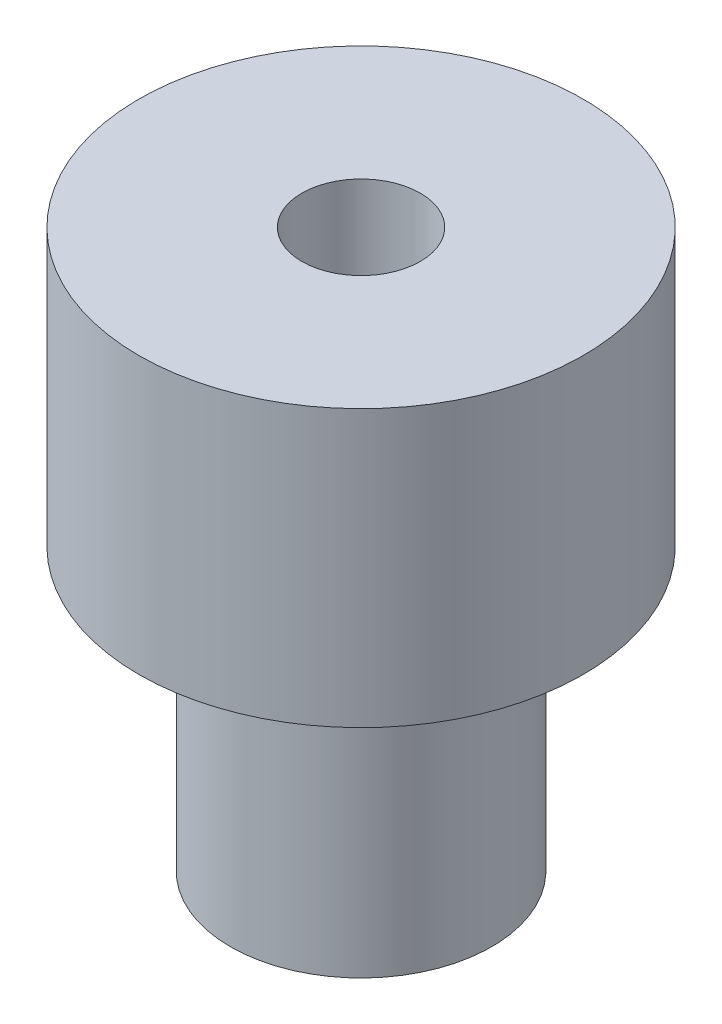
ISO-10303-21;
HEADER;
FILE_DESCRIPTION(('STEP AP214'),'2;1');
FILE_NAME('part.step','',(''),(''),'','','');
FILE_SCHEMA(('AUTOMOTIVE_DESIGN { 1 0 10303 214 1 1 1 1 }'));
ENDSEC;
DATA;
#1=APPLICATION_CONTEXT('core data for automotive mechanical design processes');
#2=APPLICATION_PROTOCOL_DEFINITION('international standard','automotive_design',2000,#1);
#3=PRODUCT_CONTEXT('',#1,'mechanical');
#4=PRODUCT('Part','Part','',(#3));
#5=PRODUCT_RELATED_PRODUCT_CATEGORY('part','',(#4));
#6=PRODUCT_DEFINITION_FORMATION('','',#4);
#7=PRODUCT_DEFINITION_CONTEXT('part definition',#1,'design');
#8=PRODUCT_DEFINITION('design','',#6,#7);
#9=PRODUCT_DEFINITION_SHAPE('','',#8);
#10=(LENGTH_UNIT() NAMED_UNIT(*) SI_UNIT(.MILLI.,.METRE.));
#11=(NAMED_UNIT(*) PLANE_ANGLE_UNIT() SI_UNIT($,.RADIAN.));
#12=(NAMED_UNIT(*) SI_UNIT($,.STERADIAN.) SOLID_ANGLE_UNIT());
#13=UNCERTAINTY_MEASURE_WITH_UNIT(LENGTH_MEASURE(1.E-05),#10,'distance_accuracy_value','');
#14=(GEOMETRIC_REPRESENTATION_CONTEXT(3) GLOBAL_UNCERTAINTY_ASSIGNED_CONTEXT((#13)) GLOBAL_UNIT_ASSIGNED_CONTEXT((#10,
#11,#12)) REPRESENTATION_CONTEXT('',''));
#15=CARTESIAN_POINT('',(0.,0.,0.));
#16=DIRECTION('',(0.,0.,1.));
#17=DIRECTION('',(1.,0.,0.));
#18=AXIS2_PLACEMENT_3D('',#15,#16,#17);
#19=CARTESIAN_POINT('',(0.,0.,0.));
#20=DIRECTION('',(0.,1.,0.));
#21=DIRECTION('',(0.,0.,1.));
#22=AXIS2_PLACEMENT_3D('',#19,#20,#21);
#23=PLANE('',#22);
#24=CARTESIAN_POINT('',(0.,0.,0.));
#25=DIRECTION('',(0.,1.,0.));
#26=DIRECTION('',(0.,0.,1.));
#27=AXIS2_PLACEMENT_3D('',#24,#25,#26);
#28=CIRCLE('',#27,5.95);
#29=CARTESIAN_POINT('',(0.,0.,5.95));
#30=VERTEX_POINT('',#29);
#31=EDGE_CURVE('E62',#30,#30,#28,.T.);
#32=ORIENTED_EDGE('',*,*,#31,.F.);
#33=EDGE_LOOP('',(#32));
#34=FACE_BOUND('',#33,.T.);
#35=CARTESIAN_POINT('',(0.,0.,0.));
#36=DIRECTION('',(0.,1.,0.));
#37=DIRECTION('',(0.,0.,1.));
#38=AXIS2_PLACEMENT_3D('',#35,#36,#37);
#39=CIRCLE('',#38,3.5);
#40=CARTESIAN_POINT('',(0.,0.,3.5));
#41=VERTEX_POINT('',#40);
#42=EDGE_CURVE('E10',#41,#41,#39,.F.);
#43=ORIENTED_EDGE('',*,*,#42,.F.);
#44=EDGE_LOOP('',(#43));
#45=FACE_BOUND('',#44,.T.);
#46=ADVANCED_FACE('F43',(#34,#45),#23,.F.);
#47=CARTESIAN_POINT('',(0.,7.4,0.));
#48=DIRECTION('',(0.,1.,0.));
#49=DIRECTION('',(0.,0.,1.));
#50=AXIS2_PLACEMENT_3D('',#47,#48,#49);
#51=PLANE('',#50);
#52=CARTESIAN_POINT('',(0.,7.4,0.));
#53=DIRECTION('',(0.,1.,0.));
#54=DIRECTION('',(0.,0.,1.));
#55=AXIS2_PLACEMENT_3D('',#52,#53,#54);
#56=CIRCLE('',#55,5.95);
#57=CARTESIAN_POINT('',(0.,7.4,5.95));
#58=VERTEX_POINT('',#57);
#59=EDGE_CURVE('E57',#58,#58,#56,.T.);
#60=ORIENTED_EDGE('',*,*,#59,.T.);
#61=EDGE_LOOP('',(#60));
#62=FACE_BOUND('',#61,.T.);
#63=CARTESIAN_POINT('',(0.,7.4,0.));
#64=DIRECTION('',(0.,1.,0.));
#65=DIRECTION('',(0.,0.,1.));
#66=AXIS2_PLACEMENT_3D('',#63,#64,#65);
#67=CIRCLE('',#66,1.586);
#68=CARTESIAN_POINT('',(0.,7.4,1.586));
#69=VERTEX_POINT('',#68);
#70=EDGE_CURVE('E67',#69,#69,#67,.T.);
#71=ORIENTED_EDGE('',*,*,#70,.F.);
#72=EDGE_LOOP('',(#71));
#73=FACE_BOUND('',#72,.T.);
#74=ADVANCED_FACE('F109',(#62,#73),#51,.T.);
#75=CARTESIAN_POINT('',(0.,7.4,0.));
#76=DIRECTION('',(0.,-1.,0.));
#77=DIRECTION('',(0.,0.,-1.));
#78=AXIS2_PLACEMENT_3D('',#75,#76,#77);
#79=CYLINDRICAL_SURFACE('',#78,5.95);
#80=ORIENTED_EDGE('',*,*,#59,.F.);
#81=EDGE_LOOP('',(#80));
#82=FACE_BOUND('',#81,.T.);
#83=ORIENTED_EDGE('',*,*,#31,.T.);
#84=EDGE_LOOP('',(#83));
#85=FACE_BOUND('',#84,.T.);
#86=ADVANCED_FACE('F45',(#82,#85),#79,.T.);
#87=CARTESIAN_POINT('',(0.,7.4,0.));
#88=DIRECTION('',(0.,-1.,0.));
#89=DIRECTION('',(0.,0.,-1.));
#90=AXIS2_PLACEMENT_3D('',#87,#88,#89);
#91=CYLINDRICAL_SURFACE('',#90,1.586);
#92=CARTESIAN_POINT('',(-0.976163920660868,-3.77,-1.25));
#93=CARTESIAN_POINT('',(-0.976178144988395,-3.72215570902188,-1.24999348367566));
#94=CARTESIAN_POINT('',(-0.979753609791022,-3.67424286982223,-1.24722200464479));
#95=CARTESIAN_POINT('',(-0.993389512883445,-3.5799075950233,-1.23638226412492));
#96=CARTESIAN_POINT('',(-1.00347128585963,-3.53349059203715,-1.22829657532019));
#97=CARTESIAN_POINT('',(-1.03271642932617,-3.42798329293562,-1.20389381365313));
#98=CARTESIAN_POINT('',(-1.05379190652301,-3.36986611649042,-1.18572519301987));
#99=CARTESIAN_POINT('',(-1.10087332936009,-3.2585427689267,-1.14214974593277));
#100=CARTESIAN_POINT('',(-1.12689266322267,-3.20535053043537,-1.11672316839289));
#101=CARTESIAN_POINT('',(-1.19015361848097,-3.08671796004963,-1.04962267083795));
#102=CARTESIAN_POINT('',(-1.22822503181856,-3.02318027040077,-1.00536066722319));
#103=CARTESIAN_POINT('',(-1.30347069374753,-2.90501971582949,-0.905686359127173));
#104=CARTESIAN_POINT('',(-1.34064564511565,-2.85038966049071,-0.850283129560191));
#105=CARTESIAN_POINT('',(-1.40377282323898,-2.76080267075664,-0.740292597501888));
#106=CARTESIAN_POINT('',(-1.43050858345585,-2.72408272943749,-0.687596452138823));
#107=CARTESIAN_POINT('',(-1.47914865475783,-2.65848332231729,-0.575526185755475));
#108=CARTESIAN_POINT('',(-1.50106032765397,-2.6295918940241,-0.516162451879478));
#109=CARTESIAN_POINT('',(-1.53528427502846,-2.58493799161107,-0.401606379457895));
#110=CARTESIAN_POINT('',(-1.54856572237825,-2.567823179102,-0.347234038802782));
#111=CARTESIAN_POINT('',(-1.56942552638147,-2.54106896101829,-0.235616354190177));
#112=CARTESIAN_POINT('',(-1.57700694781528,-2.5314255381542,-0.178372571832662));
#113=CARTESIAN_POINT('',(-1.58584065948328,-2.52019728217196,-0.062415795842604));
#114=CARTESIAN_POINT('',(-1.58707252734326,-2.51863845181772,-0.00369867109623077));
#115=CARTESIAN_POINT('',(-1.58303863653243,-2.52375853903996,0.113148243199622));
#116=CARTESIAN_POINT('',(-1.57777239234197,-2.53043807216249,0.171277988534665));
#117=CARTESIAN_POINT('',(-1.56163097790451,-2.55105227535869,0.282305852081883));
#118=CARTESIAN_POINT('',(-1.55105136603739,-2.56460497621132,0.335320037060864));
#119=CARTESIAN_POINT('',(-1.525215724929,-2.59803614998334,0.43809109978684));
#120=CARTESIAN_POINT('',(-1.50995854849615,-2.61791617475014,0.487847174832266));
#121=CARTESIAN_POINT('',(-1.47398614683566,-2.66546150301338,0.588109903328604));
#122=CARTESIAN_POINT('',(-1.4528791071093,-2.69370429017096,0.638199440052203));
#123=CARTESIAN_POINT('',(-1.40741280950753,-2.7559163547773,0.733046036769301));
#124=CARTESIAN_POINT('',(-1.38305152003341,-2.78988921296571,0.777799732344243));
#125=CARTESIAN_POINT('',(-1.32716389958939,-2.87029303325918,0.87035558701911));
#126=CARTESIAN_POINT('',(-1.29519137530749,-2.91785078926492,0.916908116293664));
#127=CARTESIAN_POINT('',(-1.23067279001101,-3.01952455054259,1.00183996843646));
#128=CARTESIAN_POINT('',(-1.19812615586322,-3.07364746827907,1.040210557265));
#129=CARTESIAN_POINT('',(-1.13930938455981,-3.18102885485554,1.10408735309203));
#130=CARTESIAN_POINT('',(-1.11276563070332,-3.23353360583929,1.13060614320518));
#131=CARTESIAN_POINT('',(-1.06413196833484,-3.34350263483498,1.17649178605274));
#132=CARTESIAN_POINT('',(-1.04203230276013,-3.40095564352018,1.19587438595147));
#133=CARTESIAN_POINT('',(-1.01090436561627,-3.50405053343067,1.22219779601514));
#134=CARTESIAN_POINT('',(-0.999952783472872,-3.54859635800478,1.23109422014854));
#135=CARTESIAN_POINT('',(-0.98385693978719,-3.63938508126608,1.24399829648119));
#136=CARTESIAN_POINT('',(-0.978700967586157,-3.68562436209936,1.24801580837796));
#137=CARTESIAN_POINT('',(-0.975091266979015,-3.77874431333341,1.25083991444511));
#138=CARTESIAN_POINT('',(-0.976667114298413,-3.82562691017024,1.24962351365766));
#139=CARTESIAN_POINT('',(-0.986284142516629,-3.91831835340678,1.24204387009674));
#140=CARTESIAN_POINT('',(-0.994334813921868,-3.96412552198407,1.23567307215736));
#141=CARTESIAN_POINT('',(-1.01861296654447,-4.06631583491505,1.21578316936733));
#142=CARTESIAN_POINT('',(-1.03651729331956,-4.12199083993832,1.20074390187717));
#143=CARTESIAN_POINT('',(-1.07758474078272,-4.22908468830603,1.16403020694476));
#144=CARTESIAN_POINT('',(-1.10076403795871,-4.28048976113271,1.14233529621039));
#145=CARTESIAN_POINT('',(-1.1597930099853,-4.39918136873437,1.08289795329103));
#146=CARTESIAN_POINT('',(-1.19694388286759,-4.46434965684497,1.04222218955419));
#147=CARTESIAN_POINT('',(-1.27148481436731,-4.58613246492364,0.949873129998355));
#148=CARTESIAN_POINT('',(-1.30887483801465,-4.64274820698152,0.898201407959525));
#149=CARTESIAN_POINT('',(-1.37492498640457,-4.7387818821577,0.792627382236269));
#150=CARTESIAN_POINT('',(-1.40405471944933,-4.77950549330536,0.740212236065973));
#151=CARTESIAN_POINT('',(-1.45771693052088,-4.85289814296488,0.627942386310541));
#152=CARTESIAN_POINT('',(-1.48225720504108,-4.88558087155727,0.56810059213634));
#153=CARTESIAN_POINT('',(-1.52089901836077,-4.9363863884743,0.453062756943354));
#154=CARTESIAN_POINT('',(-1.53607935872867,-4.95606231372047,0.398918895409617));
#155=CARTESIAN_POINT('',(-1.56081938370374,-4.98793390505201,0.287231371027705));
#156=CARTESIAN_POINT('',(-1.57038228831186,-5.0001338566545,0.229689676729863));
#157=CARTESIAN_POINT('',(-1.58310687255644,-5.01633740111198,0.112494709102673));
#158=CARTESIAN_POINT('',(-1.58624115973767,-5.0203059204907,0.0528334972756729));
#159=CARTESIAN_POINT('',(-1.58572977925648,-5.01965720679702,-0.0664115082476604));
#160=CARTESIAN_POINT('',(-1.58208462047243,-5.01504061813948,-0.125995307418792));
#161=CARTESIAN_POINT('',(-1.56883709021762,-4.99816052825333,-0.239096397069633));
#162=CARTESIAN_POINT('',(-1.55966247663154,-4.98644581726369,-0.292748812661035));
#163=CARTESIAN_POINT('',(-1.53642061225964,-4.95649956147478,-0.397072546845276));
#164=CARTESIAN_POINT('',(-1.52235217442792,-4.93826643553916,-0.447743138677444));
#165=CARTESIAN_POINT('',(-1.48893959105514,-4.89439476354504,-0.549113229217711));
#166=CARTESIAN_POINT('',(-1.46926598724038,-4.86828427302559,-0.599497523998943));
#167=CARTESIAN_POINT('',(-1.42646754952925,-4.81033413983588,-0.695226882284059));
#168=CARTESIAN_POINT('',(-1.40334111440498,-4.77849183765908,-0.740569590673468));
#169=CARTESIAN_POINT('',(-1.35008340745127,-4.70310214773672,-0.834336489474576));
#170=CARTESIAN_POINT('',(-1.3194676545733,-4.6584838328776,-0.881622466795207));
#171=CARTESIAN_POINT('',(-1.25708769360661,-4.56290055931515,-0.968498216553592));
#172=CARTESIAN_POINT('',(-1.22532198869267,-4.5119271010607,-1.00807749672684));
#173=CARTESIAN_POINT('',(-1.16420351786775,-4.40584279196786,-1.07800852473263));
#174=CARTESIAN_POINT('',(-1.13480519306932,-4.35093998006325,-1.10863541079242));
#175=CARTESIAN_POINT('',(-1.08023587088671,-4.23539789465086,-1.16186609852798));
#176=CARTESIAN_POINT('',(-1.05505722319322,-4.17476932111139,-1.18448450436969));
#177=CARTESIAN_POINT('',(-1.0195339027873,-4.06713942002999,-1.21504048019102));
#178=CARTESIAN_POINT('',(-1.00700567532186,-4.02154675597413,-1.2253485292819));
#179=CARTESIAN_POINT('',(-0.9878890804814,-3.92835725468946,-1.24081830447534));
#180=CARTESIAN_POINT('',(-0.981278208722362,-3.88076873747495,-1.24599953645513));
#181=CARTESIAN_POINT('',(-0.976836622823037,-3.81195903986128,-1.24947373926169));
#182=CARTESIAN_POINT('',(-0.976157681392682,-3.7909861142506,-1.2500028582789));
#183=CARTESIAN_POINT('',(-0.976163920660868,-3.77,-1.25));
#184=B_SPLINE_CURVE_WITH_KNOTS('',3,(#92,#93,#94,#95,#96,#97,#98,#99,#100,#101,#102,#103,#104,
#105,#106,#107,#108,#109,#110,#111,#112,#113,#114,#115,#116,#117,#118,#119,#120,#121,#122,#123,
#124,#125,#126,#127,#128,#129,#130,#131,#132,#133,#134,#135,#136,#137,#138,#139,#140,#141,#142,
#143,#144,#145,#146,#147,#148,#149,#150,#151,#152,#153,#154,#155,#156,#157,#158,#159,#160,#161,
#162,#163,#164,#165,#166,#167,#168,#169,#170,#171,#172,#173,#174,#175,#176,#177,#178,#179,#180,
#181,#182,#183),.UNSPECIFIED.,.T.,.F.,(4,2,2,2,2,2,2,2,2,2,2,2,2,2,2,2,2,2,2,2,2,2,2,2,2,2,2,2,
2,2,2,2,2,2,2,2,2,2,2,2,2,2,2,2,2,4),(0.,0.143458905345652,0.287390630289864,0.479613786784046,
0.672365110493068,0.929985838085592,1.18739756850535,1.39531797014155,1.60291884043558,
1.77775976263962,1.95250660930709,2.12781515349428,2.30313679700879,2.46963675374467,
2.63617757797761,2.8192746786572,3.00248662411448,3.22318257958916,3.44411295660239,
3.63714766439245,3.8297538198033,3.96940074965816,4.10876499763778,4.24874215983964,
4.38892486902238,4.56907413116541,4.74978347592084,5.00450415697558,5.25918840600166,
5.47581450997308,5.69206920237976,5.87005081283846,6.04793030168197,6.22656617675573,
6.40518864361556,6.57150397836586,6.73785968272188,6.91738357978343,7.09699098996296,
7.31180509610172,7.52690964632224,7.73446356282929,7.94163701319313,8.08629345995527,
8.23039739494754,8.2933232930286),.UNSPECIFIED.);
#185=CARTESIAN_POINT('',(-0.976163920660868,-3.77,-1.25));
#186=VERTEX_POINT('',#185);
#187=EDGE_CURVE('E80',#186,#186,#184,.T.);
#188=ORIENTED_EDGE('',*,*,#187,.F.);
#189=EDGE_LOOP('',(#188));
#190=FACE_BOUND('',#189,.T.);
#191=ORIENTED_EDGE('',*,*,#70,.T.);
#192=EDGE_LOOP('',(#191));
#193=FACE_BOUND('',#192,.T.);
#194=CARTESIAN_POINT('',(0.,-7.54,0.));
#195=DIRECTION('',(0.,-1.,0.));
#196=DIRECTION('',(0.,0.,-1.));
#197=AXIS2_PLACEMENT_3D('',#194,#195,#196);
#198=CIRCLE('',#197,1.586);
#199=CARTESIAN_POINT('',(0.,-7.54,-1.586));
#200=VERTEX_POINT('',#199);
#201=EDGE_CURVE('E76',#200,#200,#198,.T.);
#202=ORIENTED_EDGE('',*,*,#201,.T.);
#203=EDGE_LOOP('',(#202));
#204=FACE_BOUND('',#203,.T.);
#205=ADVANCED_FACE('F87',(#190,#193,#204),#91,.F.);
#206=CARTESIAN_POINT('',(0.,-7.54,0.));
#207=DIRECTION('',(0.,-1.,0.));
#208=DIRECTION('',(0.,0.,-1.));
#209=AXIS2_PLACEMENT_3D('',#206,#207,#208);
#210=PLANE('',#209);
#211=CARTESIAN_POINT('',(0.,-7.54,0.));
#212=DIRECTION('',(0.,-1.,0.));
#213=DIRECTION('',(0.,0.,-1.));
#214=AXIS2_PLACEMENT_3D('',#211,#212,#213);
#215=CIRCLE('',#214,3.5);
#216=CARTESIAN_POINT('',(0.,-7.54,-3.5));
#217=VERTEX_POINT('',#216);
#218=EDGE_CURVE('E72',#217,#217,#215,.T.);
#219=ORIENTED_EDGE('',*,*,#218,.T.);
#220=EDGE_LOOP('',(#219));
#221=FACE_BOUND('',#220,.T.);
#222=ORIENTED_EDGE('',*,*,#201,.F.);
#223=EDGE_LOOP('',(#222));
#224=FACE_BOUND('',#223,.T.);
#225=ADVANCED_FACE('F96',(#221,#224),#210,.T.);
#226=CARTESIAN_POINT('',(0.,-7.54,0.));
#227=DIRECTION('',(0.,1.,0.));
#228=DIRECTION('',(0.,0.,1.));
#229=AXIS2_PLACEMENT_3D('',#226,#227,#228);
#230=CYLINDRICAL_SURFACE('',#229,3.5);
#231=CARTESIAN_POINT('',(-3.2691742076555,-3.77,-1.25));
#232=CARTESIAN_POINT('',(-3.26917292438196,-3.70223646881701,-1.2500014657168));
#233=CARTESIAN_POINT('',(-3.27130407050731,-3.63448306822128,-1.24447124723087));
#234=CARTESIAN_POINT('',(-3.27954557728381,-3.50100354053551,-1.22258548426208));
#235=CARTESIAN_POINT('',(-3.28565613446978,-3.43527751374117,-1.20622940511182));
#236=CARTESIAN_POINT('',(-3.30107790836764,-3.30781262046205,-1.16335593318025));
#237=CARTESIAN_POINT('',(-3.3103820813109,-3.24606533157396,-1.13686088802958));
#238=CARTESIAN_POINT('',(-3.33113188929166,-3.12786956560526,-1.07453961334162));
#239=CARTESIAN_POINT('',(-3.34257809808702,-3.07142251432457,-1.03871088270724));
#240=CARTESIAN_POINT('',(-3.36689966125499,-2.96288940054369,-0.957012237945704));
#241=CARTESIAN_POINT('',(-3.37981431712589,-2.91107606896804,-0.910791620570068));
#242=CARTESIAN_POINT('',(-3.40528790174668,-2.81574657565947,-0.810367255990525));
#243=CARTESIAN_POINT('',(-3.41784676295918,-2.77223198033609,-0.756162005080267));
#244=CARTESIAN_POINT('',(-3.4416554889862,-2.69345545657362,-0.639270438808907));
#245=CARTESIAN_POINT('',(-3.45285383406514,-2.65848525378488,-0.576376093851267));
#246=CARTESIAN_POINT('',(-3.47221153381931,-2.59973247227305,-0.445127531707925));
#247=CARTESIAN_POINT('',(-3.48037183737504,-2.5759463997661,-0.376775027399535));
#248=CARTESIAN_POINT('',(-3.49245530799316,-2.54117952559996,-0.239414363324649));
#249=CARTESIAN_POINT('',(-3.49653304673083,-2.52973021988224,-0.170538642602653));
#250=CARTESIAN_POINT('',(-3.50054398952422,-2.51846580508615,-0.0317308606240278));
#251=CARTESIAN_POINT('',(-3.50047841683989,-2.5186472621734,0.0382008827594682));
#252=CARTESIAN_POINT('',(-3.49631130383425,-2.53035559878231,0.173796186747276));
#253=CARTESIAN_POINT('',(-3.49239127067778,-2.54137225319108,0.239510325909295));
#254=CARTESIAN_POINT('',(-3.4811892594591,-2.57358642557157,0.368087065850937));
#255=CARTESIAN_POINT('',(-3.47390704664955,-2.59478465442487,0.430949467185625));
#256=CARTESIAN_POINT('',(-3.45658253893038,-2.64702345791291,0.553080483404854));
#257=CARTESIAN_POINT('',(-3.44650297132745,-2.67819788349761,0.612286340929431));
#258=CARTESIAN_POINT('',(-3.4246167895169,-2.74938957004896,0.724767597934832));
#259=CARTESIAN_POINT('',(-3.41280964940655,-2.7894095256478,0.778041182802281));
#260=CARTESIAN_POINT('',(-3.38795176821394,-2.87966538796732,0.880166240160418));
#261=CARTESIAN_POINT('',(-3.37486828997372,-2.93033345097223,0.928628391331526));
#262=CARTESIAN_POINT('',(-3.34944981191468,-3.0391717437094,1.01650555440789));
#263=CARTESIAN_POINT('',(-3.33711496612903,-3.09734350970569,1.05591870906859));
#264=CARTESIAN_POINT('',(-3.31439562189586,-3.22093882597788,1.12522950569523));
#265=CARTESIAN_POINT('',(-3.3040513832118,-3.28647653328192,1.15493781879361));
#266=CARTESIAN_POINT('',(-3.28694869806869,-3.42208972604739,1.20275553291115));
#267=CARTESIAN_POINT('',(-3.2801884778585,-3.49216294755289,1.22087067237907));
#268=CARTESIAN_POINT('',(-3.27143002768992,-3.63104194286793,1.24414358032316));
#269=CARTESIAN_POINT('',(-3.26920708180296,-3.69973090633461,1.24991352345505));
#270=CARTESIAN_POINT('',(-3.26914209334096,-3.83711668761275,1.25008448921425));
#271=CARTESIAN_POINT('',(-3.27129909588941,-3.90581350044805,1.24448798984991));
#272=CARTESIAN_POINT('',(-3.27952452452363,-4.03828688736255,1.22263799772668));
#273=CARTESIAN_POINT('',(-3.28542708774359,-4.10214937178817,1.20683592994393));
#274=CARTESIAN_POINT('',(-3.30028809464655,-4.22629495749711,1.16557961975037));
#275=CARTESIAN_POINT('',(-3.30924712838686,-4.28657736499969,1.14012351350351));
#276=CARTESIAN_POINT('',(-3.32959948938642,-4.40420008874396,1.07927201741359));
#277=CARTESIAN_POINT('',(-3.34106719910993,-4.46136296289128,1.04355922754481));
#278=CARTESIAN_POINT('',(-3.3650114872521,-4.56910386040154,0.963555281036771));
#279=CARTESIAN_POINT('',(-3.3774884033877,-4.61967966459128,0.919261245827038));
#280=CARTESIAN_POINT('',(-3.40289783219847,-4.71577134499811,0.820385217502025));
#281=CARTESIAN_POINT('',(-3.41581623964053,-4.76083969273136,0.765363258315928));
#282=CARTESIAN_POINT('',(-3.43996864684916,-4.84114634252536,0.64821857181739));
#283=CARTESIAN_POINT('',(-3.45120267476866,-4.87638480889246,0.586095963216703));
#284=CARTESIAN_POINT('',(-3.47068992079872,-4.93575011170409,0.456690236963214));
#285=CARTESIAN_POINT('',(-3.47895813089701,-4.95993300873034,0.389435219661488));
#286=CARTESIAN_POINT('',(-3.49164167991555,-4.99652342952858,0.251453449460869));
#287=CARTESIAN_POINT('',(-3.49605864126052,-5.00893591204424,0.180728171763231));
#288=CARTESIAN_POINT('',(-3.50040190941305,-5.02113648332217,0.0418787546430673));
#289=CARTESIAN_POINT('',(-3.50055532713249,-5.02156305322447,-0.0261827249779375));
#290=CARTESIAN_POINT('',(-3.49693182545721,-5.01139231150664,-0.161363401845738));
#291=CARTESIAN_POINT('',(-3.49315530819592,-5.00079612779777,-0.228482694790275));
#292=CARTESIAN_POINT('',(-3.48219155536997,-4.96931993535221,-0.3584906611653));
#293=CARTESIAN_POINT('',(-3.47507564040231,-4.94865463831576,-0.42143777799965));
#294=CARTESIAN_POINT('',(-3.45816943849313,-4.89783345463454,-0.542985717130838));
#295=CARTESIAN_POINT('',(-3.44837865047326,-4.8676757896432,-0.601585722474542));
#296=CARTESIAN_POINT('',(-3.42662745242743,-4.79734432383809,-0.71534116903704));
#297=CARTESIAN_POINT('',(-3.41459585580279,-4.75681776245079,-0.770264674501974));
#298=CARTESIAN_POINT('',(-3.3898552302368,-4.66747377040415,-0.872734236383779));
#299=CARTESIAN_POINT('',(-3.37714597079416,-4.61865350620834,-0.920277760776972));
#300=CARTESIAN_POINT('',(-3.35176441921256,-4.51139058641294,-1.00891110432271));
#301=CARTESIAN_POINT('',(-3.33912156501336,-4.45260506129054,-1.04959590102612));
#302=CARTESIAN_POINT('',(-3.31600175800823,-4.32863079284462,-1.12050399405574));
#303=CARTESIAN_POINT('',(-3.30552465910575,-4.26344248187529,-1.15072799613439));
#304=CARTESIAN_POINT('',(-3.28804606616516,-4.12812953808138,-1.19976666603697));
#305=CARTESIAN_POINT('',(-3.28105913209347,-4.05798559681381,-1.21853360937359));
#306=CARTESIAN_POINT('',(-3.27162502953463,-3.9152230532312,-1.24364637412568));
#307=CARTESIAN_POINT('',(-3.26917558262796,-3.84260571155641,-1.24999842954744));
#308=CARTESIAN_POINT('',(-3.2691742076555,-3.77,-1.25));
#309=B_SPLINE_CURVE_WITH_KNOTS('',3,(#231,#232,#233,#234,#235,#236,#237,#238,#239,#240,#241,
#242,#243,#244,#245,#246,#247,#248,#249,#250,#251,#252,#253,#254,#255,#256,#257,#258,#259,#260,
#261,#262,#263,#264,#265,#266,#267,#268,#269,#270,#271,#272,#273,#274,#275,#276,#277,#278,#279,
#280,#281,#282,#283,#284,#285,#286,#287,#288,#289,#290,#291,#292,#293,#294,#295,#296,#297,#298,
#299,#300,#301,#302,#303,#304,#305,#306,#307,#308),.UNSPECIFIED.,.T.,.F.,(4,2,2,2,2,2,2,2,2,2,2,
2,2,2,2,2,2,2,2,2,2,2,2,2,2,2,2,2,2,2,2,2,2,2,2,2,2,2,4),(0.,0.203020883138165,
0.406051793815672,0.608637751162819,0.811278050310596,1.02220501259777,1.23317174861701,
1.45056406841855,1.66788843235756,1.8766323011199,2.08531454120127,2.28461868668642,
2.48393674968961,2.68604985529561,2.88822461610465,3.10122083881643,3.31426073854221,
3.53123804647412,3.74810787062262,3.95394726789477,4.15974179475175,4.35700470913191,
4.55430572705358,4.75852942964242,4.96282175786679,5.17866024153272,5.39449511724439,
5.60922305543413,5.82386049090848,6.02704135069306,6.23020142189366,6.42920732216897,
6.6282505273945,6.83526508050384,7.04235050272176,7.25910581081151,7.47584649234335,
7.69348395638331,7.91101210793804),.UNSPECIFIED.);
#310=CARTESIAN_POINT('',(-3.2691742076555,-3.77,-1.25));
#311=VERTEX_POINT('',#310);
#312=EDGE_CURVE('E47',#311,#311,#309,.T.);
#313=ORIENTED_EDGE('',*,*,#312,.T.);
#314=EDGE_LOOP('',(#313));
#315=FACE_BOUND('',#314,.T.);
#316=ORIENTED_EDGE('',*,*,#218,.F.);
#317=EDGE_LOOP('',(#316));
#318=FACE_BOUND('',#317,.T.);
#319=ORIENTED_EDGE('',*,*,#42,.T.);
#320=EDGE_LOOP('',(#319));
#321=FACE_BOUND('',#320,.T.);
#322=ADVANCED_FACE('F94',(#315,#318,#321),#230,.T.);
#323=CARTESIAN_POINT('',(-10.,-3.77,0.));
#324=DIRECTION('',(1.,0.,0.));
#325=DIRECTION('',(0.,0.,-1.));
#326=AXIS2_PLACEMENT_3D('',#323,#324,#325);
#327=CYLINDRICAL_SURFACE('',#326,1.25);
#328=ORIENTED_EDGE('',*,*,#187,.T.);
#329=EDGE_LOOP('',(#328));
#330=FACE_BOUND('',#329,.T.);
#331=ORIENTED_EDGE('',*,*,#312,.F.);
#332=EDGE_LOOP('',(#331));
#333=FACE_BOUND('',#332,.T.);
#334=ADVANCED_FACE('F90',(#330,#333),#327,.F.);
#335=CLOSED_SHELL('',(#46,#74,#86,#205,#225,#322,#334));
#336=MANIFOLD_SOLID_BREP('B2',#335);
#337=ADVANCED_BREP_SHAPE_REPRESENTATION('',(#18,#336),#14);
#338=SHAPE_DEFINITION_REPRESENTATION(#9,#337);
ENDSEC;
END-ISO-10303-21;
